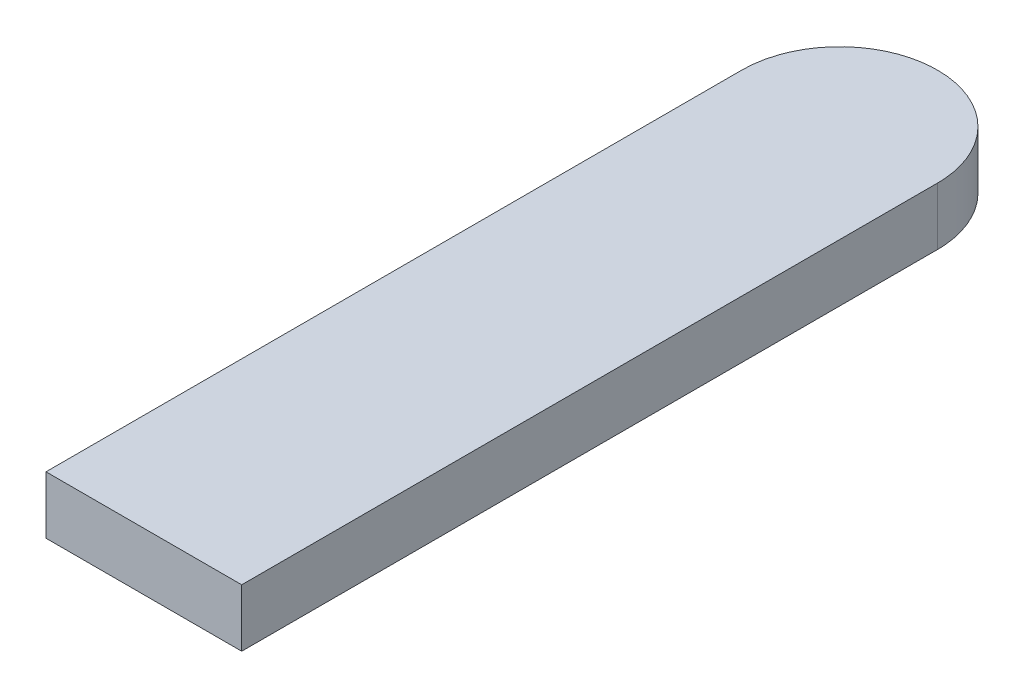
ISO-10303-21;
HEADER;
FILE_DESCRIPTION(('STEP AP214'),'2;1');
FILE_NAME('part.step','',(''),(''),'','','');
FILE_SCHEMA(('AUTOMOTIVE_DESIGN { 1 0 10303 214 1 1 1 1 }'));
ENDSEC;
DATA;
#1=APPLICATION_CONTEXT('core data for automotive mechanical design processes');
#2=APPLICATION_PROTOCOL_DEFINITION('international standard','automotive_design',2000,#1);
#3=PRODUCT_CONTEXT('',#1,'mechanical');
#4=PRODUCT('Part','Part','',(#3));
#5=PRODUCT_RELATED_PRODUCT_CATEGORY('part','',(#4));
#6=PRODUCT_DEFINITION_FORMATION('','',#4);
#7=PRODUCT_DEFINITION_CONTEXT('part definition',#1,'design');
#8=PRODUCT_DEFINITION('design','',#6,#7);
#9=PRODUCT_DEFINITION_SHAPE('','',#8);
#10=(LENGTH_UNIT() NAMED_UNIT(*) SI_UNIT(.MILLI.,.METRE.));
#11=(NAMED_UNIT(*) PLANE_ANGLE_UNIT() SI_UNIT($,.RADIAN.));
#12=(NAMED_UNIT(*) SI_UNIT($,.STERADIAN.) SOLID_ANGLE_UNIT());
#13=UNCERTAINTY_MEASURE_WITH_UNIT(LENGTH_MEASURE(1.E-05),#10,'distance_accuracy_value','');
#14=(GEOMETRIC_REPRESENTATION_CONTEXT(3) GLOBAL_UNCERTAINTY_ASSIGNED_CONTEXT((#13)) GLOBAL_UNIT_ASSIGNED_CONTEXT((#10,
#11,#12)) REPRESENTATION_CONTEXT('',''));
#15=CARTESIAN_POINT('',(0.,0.,0.));
#16=DIRECTION('',(0.,0.,1.));
#17=DIRECTION('',(1.,0.,0.));
#18=AXIS2_PLACEMENT_3D('',#15,#16,#17);
#19=CARTESIAN_POINT('',(3.13878764127891,-33.9377756628299,-24.7691765501716));
#20=DIRECTION('',(0.,-1.,0.));
#21=DIRECTION('',(0.,0.,-1.));
#22=AXIS2_PLACEMENT_3D('',#19,#20,#21);
#23=PLANE('',#22);
#24=CARTESIAN_POINT('',(3.24503764127891,-33.9377756628299,-23.9133148754059));
#25=CARTESIAN_POINT('',(3.24503764127891,-33.9377756628299,-24.3383148754059));
#26=CARTESIAN_POINT('',(3.67003764127891,-33.9377756628299,-24.3383148754059));
#27=CARTESIAN_POINT('',(4.0950376412789,-33.9377756628299,-24.3383148754059));
#28=CARTESIAN_POINT('',(4.09503764127891,-33.9377756628299,-23.9133148754059));
#29=(BOUNDED_CURVE() B_SPLINE_CURVE(2,(#24,#25,#26,#27,#28),.UNSPECIFIED.,.F.,
.F.) B_SPLINE_CURVE_WITH_KNOTS((3,2,3),(-7.29143077888166,-6.62384233999383,-5.956253901106),
.UNSPECIFIED.) CURVE() GEOMETRIC_REPRESENTATION_ITEM() RATIONAL_B_SPLINE_CURVE((1.,
0.707106781186548,1.,0.707106781186548,1.)) REPRESENTATION_ITEM(''));
#30=CARTESIAN_POINT('',(3.24503764127891,-33.9377756628299,-23.9133148754059));
#31=VERTEX_POINT('',#30);
#32=CARTESIAN_POINT('',(4.09503764127891,-33.9377756628299,-23.9133148754059));
#33=VERTEX_POINT('',#32);
#34=EDGE_CURVE('E83',#31,#33,#29,.T.);
#35=ORIENTED_EDGE('',*,*,#34,.T.);
#36=CARTESIAN_POINT('',(4.09503764127891,-33.9377756628299,-23.9133148754059));
#37=CARTESIAN_POINT('',(4.0950376412789,-33.9377756628299,-22.4023681763431));
#38=CARTESIAN_POINT('',(4.09503764127889,-33.9377756628299,-20.8914214772802));
#39=(BOUNDED_CURVE() B_SPLINE_CURVE(2,(#36,#37,#38),.UNSPECIFIED.,.F.,
.F.) B_SPLINE_CURVE_WITH_KNOTS((3,3),(-5.956253901106,-2.93436050298027),
.UNSPECIFIED.) CURVE() GEOMETRIC_REPRESENTATION_ITEM() RATIONAL_B_SPLINE_CURVE((1.,1.,1.)) REPRESENTATION_ITEM(''));
#40=CARTESIAN_POINT('',(4.09503764127889,-33.9377756628299,-20.8914214772802));
#41=VERTEX_POINT('',#40);
#42=EDGE_CURVE('E19',#33,#41,#39,.T.);
#43=ORIENTED_EDGE('',*,*,#42,.T.);
#44=CARTESIAN_POINT('',(4.09503764127889,-33.9377756628299,-20.8914214772802));
#45=CARTESIAN_POINT('',(3.6700376412789,-33.9377756628299,-20.8914214772802));
#46=CARTESIAN_POINT('',(3.24503764127891,-33.9377756628299,-20.8914214772802));
#47=(BOUNDED_CURVE() B_SPLINE_CURVE(2,(#44,#45,#46),.UNSPECIFIED.,.F.,
.F.) B_SPLINE_CURVE_WITH_KNOTS((3,3),(-2.93436050298027,-2.08436050298034),
.UNSPECIFIED.) CURVE() GEOMETRIC_REPRESENTATION_ITEM() RATIONAL_B_SPLINE_CURVE((1.,1.,1.)) REPRESENTATION_ITEM(''));
#48=CARTESIAN_POINT('',(3.24503764127891,-33.9377756628299,-20.8914214772802));
#49=VERTEX_POINT('',#48);
#50=EDGE_CURVE('E75',#41,#49,#47,.T.);
#51=ORIENTED_EDGE('',*,*,#50,.T.);
#52=CARTESIAN_POINT('',(3.24503764127891,-33.9377756628299,-20.8914214772802));
#53=CARTESIAN_POINT('',(3.24503764127891,-33.9377756628299,-22.4023681763431));
#54=CARTESIAN_POINT('',(3.24503764127891,-33.9377756628299,-23.9133148754059));
#55=(BOUNDED_CURVE() B_SPLINE_CURVE(2,(#52,#53,#54),.UNSPECIFIED.,.F.,
.F.) B_SPLINE_CURVE_WITH_KNOTS((3,3),(-2.08436050298034,0.937532895145388),
.UNSPECIFIED.) CURVE() GEOMETRIC_REPRESENTATION_ITEM() RATIONAL_B_SPLINE_CURVE((1.,1.,1.)) REPRESENTATION_ITEM(''));
#56=EDGE_CURVE('E11',#49,#31,#55,.T.);
#57=ORIENTED_EDGE('',*,*,#56,.T.);
#58=EDGE_LOOP('',(#35,#43,#51,#57));
#59=FACE_BOUND('',#58,.T.);
#60=ADVANCED_FACE('F16',(#59),#23,.T.);
#61=CARTESIAN_POINT('',(3.13878764127891,-33.6877756628299,-24.7691765501716));
#62=DIRECTION('',(0.,1.,0.));
#63=DIRECTION('',(1.,0.,0.));
#64=AXIS2_PLACEMENT_3D('',#61,#62,#63);
#65=PLANE('',#64);
#66=CARTESIAN_POINT('',(3.24503764127891,-33.6877756628299,-20.8914214772802));
#67=CARTESIAN_POINT('',(3.24503764127891,-33.6877756628299,-22.4023681763431));
#68=CARTESIAN_POINT('',(3.24503764127891,-33.6877756628299,-23.9133148754059));
#69=(BOUNDED_CURVE() B_SPLINE_CURVE(2,(#66,#67,#68),.UNSPECIFIED.,.F.,
.F.) B_SPLINE_CURVE_WITH_KNOTS((3,3),(-2.08436050298034,0.937532895145388),
.UNSPECIFIED.) CURVE() GEOMETRIC_REPRESENTATION_ITEM() RATIONAL_B_SPLINE_CURVE((1.,1.,1.)) REPRESENTATION_ITEM(''));
#70=CARTESIAN_POINT('',(3.24503764127891,-33.6877756628299,-20.8914214772802));
#71=VERTEX_POINT('',#70);
#72=CARTESIAN_POINT('',(3.24503764127891,-33.6877756628299,-23.9133148754059));
#73=VERTEX_POINT('',#72);
#74=EDGE_CURVE('E28',#71,#73,#69,.T.);
#75=ORIENTED_EDGE('',*,*,#74,.F.);
#76=CARTESIAN_POINT('',(4.09503764127889,-33.6877756628299,-20.8914214772802));
#77=CARTESIAN_POINT('',(3.6700376412789,-33.6877756628299,-20.8914214772802));
#78=CARTESIAN_POINT('',(3.24503764127891,-33.6877756628299,-20.8914214772802));
#79=(BOUNDED_CURVE() B_SPLINE_CURVE(2,(#76,#77,#78),.UNSPECIFIED.,.F.,
.F.) B_SPLINE_CURVE_WITH_KNOTS((3,3),(-2.93436050298027,-2.08436050298034),
.UNSPECIFIED.) CURVE() GEOMETRIC_REPRESENTATION_ITEM() RATIONAL_B_SPLINE_CURVE((1.,1.,1.)) REPRESENTATION_ITEM(''));
#80=CARTESIAN_POINT('',(4.09503764127889,-33.6877756628299,-20.8914214772802));
#81=VERTEX_POINT('',#80);
#82=EDGE_CURVE('E145',#81,#71,#79,.T.);
#83=ORIENTED_EDGE('',*,*,#82,.F.);
#84=CARTESIAN_POINT('',(4.09503764127891,-33.6877756628299,-23.9133148754059));
#85=CARTESIAN_POINT('',(4.0950376412789,-33.6877756628299,-22.4023681763431));
#86=CARTESIAN_POINT('',(4.09503764127889,-33.6877756628299,-20.8914214772802));
#87=(BOUNDED_CURVE() B_SPLINE_CURVE(2,(#84,#85,#86),.UNSPECIFIED.,.F.,
.F.) B_SPLINE_CURVE_WITH_KNOTS((3,3),(-5.956253901106,-2.93436050298027),
.UNSPECIFIED.) CURVE() GEOMETRIC_REPRESENTATION_ITEM() RATIONAL_B_SPLINE_CURVE((1.,1.,1.)) REPRESENTATION_ITEM(''));
#88=CARTESIAN_POINT('',(4.09503764127891,-33.6877756628299,-23.9133148754059));
#89=VERTEX_POINT('',#88);
#90=EDGE_CURVE('E85',#89,#81,#87,.T.);
#91=ORIENTED_EDGE('',*,*,#90,.F.);
#92=CARTESIAN_POINT('',(3.24503764127891,-33.6877756628299,-23.9133148754059));
#93=CARTESIAN_POINT('',(3.24503764127891,-33.6877756628299,-24.3383148754059));
#94=CARTESIAN_POINT('',(3.67003764127891,-33.6877756628299,-24.3383148754059));
#95=CARTESIAN_POINT('',(4.0950376412789,-33.6877756628299,-24.3383148754059));
#96=CARTESIAN_POINT('',(4.09503764127891,-33.6877756628299,-23.9133148754059));
#97=(BOUNDED_CURVE() B_SPLINE_CURVE(2,(#92,#93,#94,#95,#96),.UNSPECIFIED.,.F.,
.F.) B_SPLINE_CURVE_WITH_KNOTS((3,2,3),(-7.29143077888166,-6.62384233999383,-5.956253901106),
.UNSPECIFIED.) CURVE() GEOMETRIC_REPRESENTATION_ITEM() RATIONAL_B_SPLINE_CURVE((1.,
0.707106781186548,1.,0.707106781186548,1.)) REPRESENTATION_ITEM(''));
#98=EDGE_CURVE('E81',#73,#89,#97,.T.);
#99=ORIENTED_EDGE('',*,*,#98,.F.);
#100=EDGE_LOOP('',(#75,#83,#91,#99));
#101=FACE_BOUND('',#100,.T.);
#102=ADVANCED_FACE('F87',(#101),#65,.T.);
#103=CARTESIAN_POINT('',(3.24503764127891,-33.6877756628299,-20.8914214772802));
#104=CARTESIAN_POINT('',(3.24503764127891,-33.9377756628299,-20.8914214772802));
#105=CARTESIAN_POINT('',(3.24503764127891,-33.6877756628299,-22.4023681763431));
#106=CARTESIAN_POINT('',(3.24503764127891,-33.9377756628299,-22.4023681763431));
#107=CARTESIAN_POINT('',(3.24503764127891,-33.6877756628299,-23.9133148754059));
#108=CARTESIAN_POINT('',(3.24503764127891,-33.9377756628299,-23.9133148754059));
#109=(BOUNDED_SURFACE() B_SPLINE_SURFACE(2,1,((#103,#104),(#105,#106),(#107,#108)),
.UNSPECIFIED.,.F.,.F.,.F.) B_SPLINE_SURFACE_WITH_KNOTS((3,3),(2,2),(-2.08436050298034,
0.937532895145388),(0.,0.25),
.UNSPECIFIED.) GEOMETRIC_REPRESENTATION_ITEM() RATIONAL_B_SPLINE_SURFACE(((1.,1.),(1.,1.),(1.,1.))) REPRESENTATION_ITEM('') SURFACE());
#110=CARTESIAN_POINT('',(3.24503764127891,-33.6877756628299,-23.9133148754059));
#111=CARTESIAN_POINT('',(3.24503764127891,-33.9377756628299,-23.9133148754059));
#112=(BOUNDED_CURVE() B_SPLINE_CURVE(1,(#110,#111),.UNSPECIFIED.,.F.,
.F.) B_SPLINE_CURVE_WITH_KNOTS((2,2),(0.,0.25),
.UNSPECIFIED.) CURVE() GEOMETRIC_REPRESENTATION_ITEM() RATIONAL_B_SPLINE_CURVE((1.,1.)) REPRESENTATION_ITEM(''));
#113=EDGE_CURVE('E67',#73,#31,#112,.T.);
#114=CARTESIAN_POINT('',(3.24503764127891,-33.6877756628299,-20.8914214772802));
#115=CARTESIAN_POINT('',(3.24503764127891,-33.9377756628299,-20.8914214772802));
#116=(BOUNDED_CURVE() B_SPLINE_CURVE(1,(#114,#115),.UNSPECIFIED.,.F.,
.F.) B_SPLINE_CURVE_WITH_KNOTS((2,2),(0.,0.25),
.UNSPECIFIED.) CURVE() GEOMETRIC_REPRESENTATION_ITEM() RATIONAL_B_SPLINE_CURVE((1.,1.)) REPRESENTATION_ITEM(''));
#117=EDGE_CURVE('E70',#71,#49,#116,.T.);
#118=ORIENTED_EDGE('',*,*,#74,.T.);
#119=ORIENTED_EDGE('',*,*,#113,.T.);
#120=ORIENTED_EDGE('',*,*,#56,.F.);
#121=ORIENTED_EDGE('',*,*,#117,.F.);
#122=EDGE_LOOP('',(#118,#119,#120,#121));
#123=FACE_BOUND('',#122,.T.);
#124=ADVANCED_FACE('F66',(#123),#109,.T.);
#125=CARTESIAN_POINT('',(4.09503764127889,-33.6877756628299,-20.8914214772802));
#126=CARTESIAN_POINT('',(4.09503764127889,-33.9377756628299,-20.8914214772802));
#127=CARTESIAN_POINT('',(3.6700376412789,-33.6877756628299,-20.8914214772802));
#128=CARTESIAN_POINT('',(3.6700376412789,-33.9377756628299,-20.8914214772802));
#129=CARTESIAN_POINT('',(3.24503764127891,-33.6877756628299,-20.8914214772802));
#130=CARTESIAN_POINT('',(3.24503764127891,-33.9377756628299,-20.8914214772802));
#131=(BOUNDED_SURFACE() B_SPLINE_SURFACE(2,1,((#125,#126),(#127,#128),(#129,#130)),
.UNSPECIFIED.,.F.,.F.,.F.) B_SPLINE_SURFACE_WITH_KNOTS((3,3),(2,2),(-2.93436050298027,
-2.08436050298034),(0.,0.25),
.UNSPECIFIED.) GEOMETRIC_REPRESENTATION_ITEM() RATIONAL_B_SPLINE_SURFACE(((1.,1.),(1.,1.),(1.,1.))) REPRESENTATION_ITEM('') SURFACE());
#132=CARTESIAN_POINT('',(4.09503764127889,-33.6877756628299,-20.8914214772802));
#133=CARTESIAN_POINT('',(4.09503764127889,-33.9377756628299,-20.8914214772802));
#134=(BOUNDED_CURVE() B_SPLINE_CURVE(1,(#132,#133),.UNSPECIFIED.,.F.,
.F.) B_SPLINE_CURVE_WITH_KNOTS((2,2),(0.,0.25),
.UNSPECIFIED.) CURVE() GEOMETRIC_REPRESENTATION_ITEM() RATIONAL_B_SPLINE_CURVE((1.,1.)) REPRESENTATION_ITEM(''));
#135=EDGE_CURVE('E104',#81,#41,#134,.T.);
#136=ORIENTED_EDGE('',*,*,#82,.T.);
#137=ORIENTED_EDGE('',*,*,#117,.T.);
#138=ORIENTED_EDGE('',*,*,#50,.F.);
#139=ORIENTED_EDGE('',*,*,#135,.F.);
#140=EDGE_LOOP('',(#136,#137,#138,#139));
#141=FACE_BOUND('',#140,.T.);
#142=ADVANCED_FACE('F175',(#141),#131,.T.);
#143=CARTESIAN_POINT('',(4.09503764127891,-33.6877756628299,-23.9133148754059));
#144=CARTESIAN_POINT('',(4.09503764127891,-33.9377756628299,-23.9133148754059));
#145=CARTESIAN_POINT('',(4.0950376412789,-33.6877756628299,-22.4023681763431));
#146=CARTESIAN_POINT('',(4.0950376412789,-33.9377756628299,-22.4023681763431));
#147=CARTESIAN_POINT('',(4.09503764127889,-33.6877756628299,-20.8914214772802));
#148=CARTESIAN_POINT('',(4.09503764127889,-33.9377756628299,-20.8914214772802));
#149=(BOUNDED_SURFACE() B_SPLINE_SURFACE(2,1,((#143,#144),(#145,#146),(#147,#148)),
.UNSPECIFIED.,.F.,.F.,.F.) B_SPLINE_SURFACE_WITH_KNOTS((3,3),(2,2),(-5.956253901106,
-2.93436050298027),(0.,0.25),
.UNSPECIFIED.) GEOMETRIC_REPRESENTATION_ITEM() RATIONAL_B_SPLINE_SURFACE(((1.,1.),(1.,1.),(1.,1.))) REPRESENTATION_ITEM('') SURFACE());
#150=CARTESIAN_POINT('',(4.09503764127891,-33.6877756628299,-23.9133148754059));
#151=CARTESIAN_POINT('',(4.09503764127891,-33.9377756628299,-23.9133148754059));
#152=(BOUNDED_CURVE() B_SPLINE_CURVE(1,(#150,#151),.UNSPECIFIED.,.F.,
.F.) B_SPLINE_CURVE_WITH_KNOTS((2,2),(0.,0.25),
.UNSPECIFIED.) CURVE() GEOMETRIC_REPRESENTATION_ITEM() RATIONAL_B_SPLINE_CURVE((1.,1.)) REPRESENTATION_ITEM(''));
#153=EDGE_CURVE('E91',#89,#33,#152,.T.);
#154=ORIENTED_EDGE('',*,*,#90,.T.);
#155=ORIENTED_EDGE('',*,*,#135,.T.);
#156=ORIENTED_EDGE('',*,*,#42,.F.);
#157=ORIENTED_EDGE('',*,*,#153,.F.);
#158=EDGE_LOOP('',(#154,#155,#156,#157));
#159=FACE_BOUND('',#158,.T.);
#160=ADVANCED_FACE('F174',(#159),#149,.T.);
#161=CARTESIAN_POINT('',(3.24503764127891,-33.6877756628299,-23.9133148754059));
#162=CARTESIAN_POINT('',(3.24503764127891,-33.9377756628299,-23.9133148754059));
#163=CARTESIAN_POINT('',(3.24503764127891,-33.6877756628299,-24.3383148754059));
#164=CARTESIAN_POINT('',(3.24503764127891,-33.9377756628299,-24.3383148754059));
#165=CARTESIAN_POINT('',(3.67003764127891,-33.6877756628299,-24.3383148754059));
#166=CARTESIAN_POINT('',(3.67003764127891,-33.9377756628299,-24.3383148754059));
#167=CARTESIAN_POINT('',(4.0950376412789,-33.6877756628299,-24.3383148754059));
#168=CARTESIAN_POINT('',(4.0950376412789,-33.9377756628299,-24.3383148754059));
#169=CARTESIAN_POINT('',(4.09503764127891,-33.6877756628299,-23.9133148754059));
#170=CARTESIAN_POINT('',(4.09503764127891,-33.9377756628299,-23.9133148754059));
#171=(BOUNDED_SURFACE() B_SPLINE_SURFACE(2,1,((#161,#162),(#163,#164),(#165,#166),(#167,#168),
(#169,#170)),.UNSPECIFIED.,.F.,.F.,.F.) B_SPLINE_SURFACE_WITH_KNOTS((3,2,3),(2,2),
(-7.29143077888166,-6.62384233999383,-5.956253901106),(0.,0.25),
.UNSPECIFIED.) GEOMETRIC_REPRESENTATION_ITEM() RATIONAL_B_SPLINE_SURFACE(((1.,1.),
(0.707106781186548,0.707106781186548),(1.,1.),(0.707106781186548,0.707106781186548),(1.,1.))) REPRESENTATION_ITEM('') SURFACE());
#172=ORIENTED_EDGE('',*,*,#98,.T.);
#173=ORIENTED_EDGE('',*,*,#153,.T.);
#174=ORIENTED_EDGE('',*,*,#34,.F.);
#175=ORIENTED_EDGE('',*,*,#113,.F.);
#176=EDGE_LOOP('',(#172,#173,#174,#175));
#177=FACE_BOUND('',#176,.T.);
#178=ADVANCED_FACE('F79',(#177),#171,.T.);
#179=CLOSED_SHELL('',(#60,#102,#124,#142,#160,#178));
#180=MANIFOLD_SOLID_BREP('B1',#179);
#181=ADVANCED_BREP_SHAPE_REPRESENTATION('',(#18,#180),#14);
#182=SHAPE_DEFINITION_REPRESENTATION(#9,#181);
ENDSEC;
END-ISO-10303-21;
